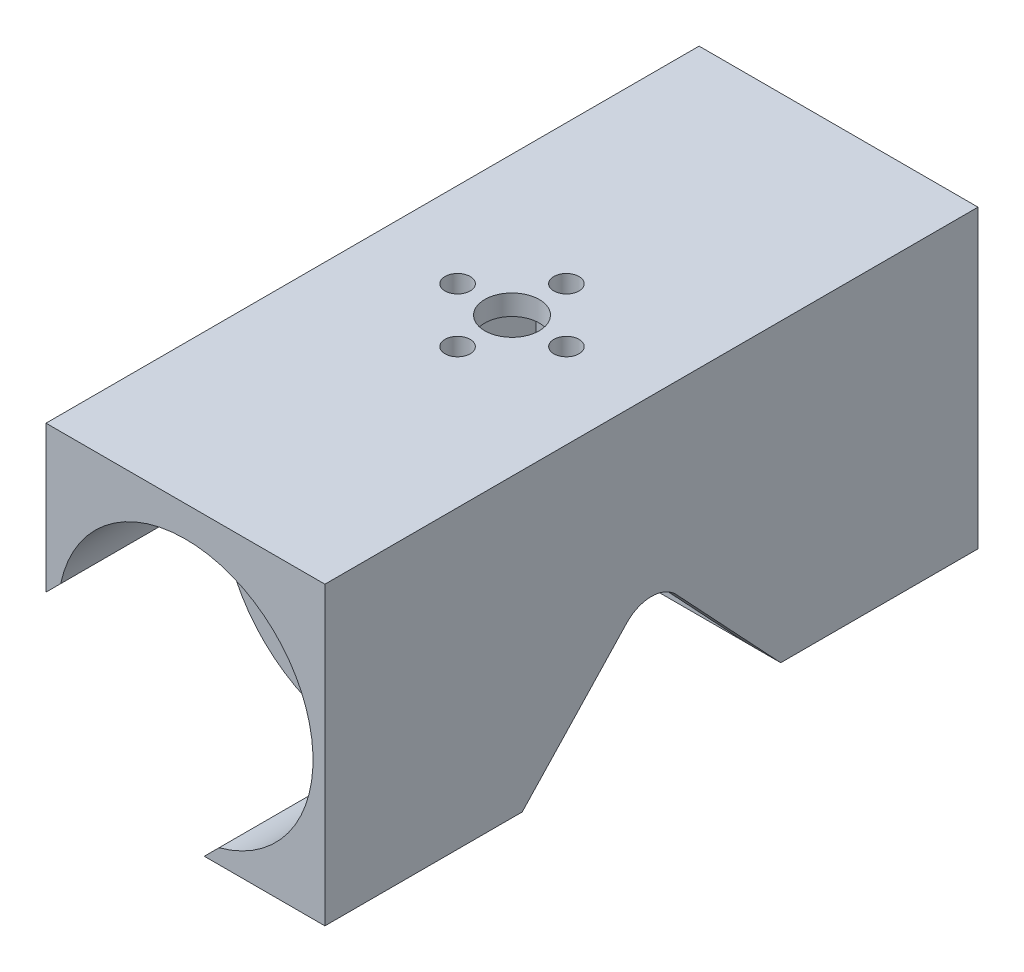
ISO-10303-21;
HEADER;
FILE_DESCRIPTION(('STEP AP214'),'2;1');
FILE_NAME('part.step','',(''),(''),'','','');
FILE_SCHEMA(('AUTOMOTIVE_DESIGN { 1 0 10303 214 1 1 1 1 }'));
ENDSEC;
DATA;
#1=APPLICATION_CONTEXT('core data for automotive mechanical design processes');
#2=APPLICATION_PROTOCOL_DEFINITION('international standard','automotive_design',2000,#1);
#3=PRODUCT_CONTEXT('',#1,'mechanical');
#4=PRODUCT('Part','Part','',(#3));
#5=PRODUCT_RELATED_PRODUCT_CATEGORY('part','',(#4));
#6=PRODUCT_DEFINITION_FORMATION('','',#4);
#7=PRODUCT_DEFINITION_CONTEXT('part definition',#1,'design');
#8=PRODUCT_DEFINITION('design','',#6,#7);
#9=PRODUCT_DEFINITION_SHAPE('','',#8);
#10=(LENGTH_UNIT() NAMED_UNIT(*) SI_UNIT(.MILLI.,.METRE.));
#11=(NAMED_UNIT(*) PLANE_ANGLE_UNIT() SI_UNIT($,.RADIAN.));
#12=(NAMED_UNIT(*) SI_UNIT($,.STERADIAN.) SOLID_ANGLE_UNIT());
#13=UNCERTAINTY_MEASURE_WITH_UNIT(LENGTH_MEASURE(1.E-05),#10,'distance_accuracy_value','');
#14=(GEOMETRIC_REPRESENTATION_CONTEXT(3) GLOBAL_UNCERTAINTY_ASSIGNED_CONTEXT((#13)) GLOBAL_UNIT_ASSIGNED_CONTEXT((#10,
#11,#12)) REPRESENTATION_CONTEXT('',''));
#15=CARTESIAN_POINT('',(0.,0.,0.));
#16=DIRECTION('',(0.,0.,1.));
#17=DIRECTION('',(1.,0.,0.));
#18=AXIS2_PLACEMENT_3D('',#15,#16,#17);
#19=CARTESIAN_POINT('',(0.,-3.,0.));
#20=DIRECTION('',(0.,1.,0.));
#21=DIRECTION('',(0.,0.,1.));
#22=AXIS2_PLACEMENT_3D('',#19,#20,#21);
#23=PLANE('',#22);
#24=CARTESIAN_POINT('',(0.,-3.,0.));
#25=DIRECTION('',(0.,1.,0.));
#26=DIRECTION('',(0.,0.,1.));
#27=AXIS2_PLACEMENT_3D('',#24,#25,#26);
#28=CIRCLE('',#27,4.);
#29=CARTESIAN_POINT('',(0.,-3.,4.));
#30=VERTEX_POINT('',#29);
#31=EDGE_CURVE('E323',#30,#30,#28,.F.);
#32=ORIENTED_EDGE('',*,*,#31,.F.);
#33=EDGE_LOOP('',(#32));
#34=FACE_BOUND('',#33,.T.);
#35=CARTESIAN_POINT('',(-8.,-3.,0.));
#36=DIRECTION('',(0.,1.,0.));
#37=DIRECTION('',(0.,0.,1.));
#38=AXIS2_PLACEMENT_3D('',#35,#36,#37);
#39=CIRCLE('',#38,1.85);
#40=CARTESIAN_POINT('',(-8.,-3.,1.85));
#41=VERTEX_POINT('',#40);
#42=EDGE_CURVE('E315',#41,#41,#39,.F.);
#43=ORIENTED_EDGE('',*,*,#42,.F.);
#44=EDGE_LOOP('',(#43));
#45=FACE_BOUND('',#44,.T.);
#46=CARTESIAN_POINT('',(8.,-3.,0.));
#47=DIRECTION('',(0.,1.,0.));
#48=DIRECTION('',(0.,0.,1.));
#49=AXIS2_PLACEMENT_3D('',#46,#47,#48);
#50=CIRCLE('',#49,1.85);
#51=CARTESIAN_POINT('',(8.,-3.,1.85));
#52=VERTEX_POINT('',#51);
#53=EDGE_CURVE('E310',#52,#52,#50,.F.);
#54=ORIENTED_EDGE('',*,*,#53,.F.);
#55=EDGE_LOOP('',(#54));
#56=FACE_BOUND('',#55,.T.);
#57=CARTESIAN_POINT('',(0.,-3.,-8.));
#58=DIRECTION('',(0.,1.,0.));
#59=DIRECTION('',(0.,0.,1.));
#60=AXIS2_PLACEMENT_3D('',#57,#58,#59);
#61=CIRCLE('',#60,1.85);
#62=CARTESIAN_POINT('',(0.,-3.,-6.15));
#63=VERTEX_POINT('',#62);
#64=EDGE_CURVE('E311',#63,#63,#61,.F.);
#65=ORIENTED_EDGE('',*,*,#64,.F.);
#66=EDGE_LOOP('',(#65));
#67=FACE_BOUND('',#66,.T.);
#68=CARTESIAN_POINT('',(0.,-3.,8.));
#69=DIRECTION('',(0.,1.,0.));
#70=DIRECTION('',(0.,0.,1.));
#71=AXIS2_PLACEMENT_3D('',#68,#69,#70);
#72=CIRCLE('',#71,1.85);
#73=CARTESIAN_POINT('',(0.,-3.,9.85));
#74=VERTEX_POINT('',#73);
#75=EDGE_CURVE('E319',#74,#74,#72,.F.);
#76=ORIENTED_EDGE('',*,*,#75,.F.);
#77=EDGE_LOOP('',(#76));
#78=FACE_BOUND('',#77,.T.);
#79=DIRECTION('',(0.,0.,-1.));
#80=VECTOR('',#79,1.);
#81=CARTESIAN_POINT('',(-15.5,-3.,0.));
#82=LINE('',#81,#80);
#83=CARTESIAN_POINT('',(-15.5,-3.,19.));
#84=VERTEX_POINT('',#83);
#85=CARTESIAN_POINT('',(-15.5,-3.,-19.));
#86=VERTEX_POINT('',#85);
#87=EDGE_CURVE('E232',#84,#86,#82,.T.);
#88=ORIENTED_EDGE('',*,*,#87,.T.);
#89=DIRECTION('',(1.,0.,0.));
#90=VECTOR('',#89,1.);
#91=CARTESIAN_POINT('',(-20.5,-3.,-19.));
#92=LINE('',#91,#90);
#93=CARTESIAN_POINT('',(15.5,-3.,-19.));
#94=VERTEX_POINT('',#93);
#95=EDGE_CURVE('E67',#86,#94,#92,.T.);
#96=ORIENTED_EDGE('',*,*,#95,.T.);
#97=DIRECTION('',(0.,0.,1.));
#98=VECTOR('',#97,1.);
#99=CARTESIAN_POINT('',(15.5,-3.,0.));
#100=LINE('',#99,#98);
#101=CARTESIAN_POINT('',(15.5,-3.,19.));
#102=VERTEX_POINT('',#101);
#103=EDGE_CURVE('E262',#94,#102,#100,.T.);
#104=ORIENTED_EDGE('',*,*,#103,.T.);
#105=DIRECTION('',(-1.,0.,0.));
#106=VECTOR('',#105,1.);
#107=CARTESIAN_POINT('',(-20.5,-3.,19.));
#108=LINE('',#107,#106);
#109=EDGE_CURVE('E306',#102,#84,#108,.T.);
#110=ORIENTED_EDGE('',*,*,#109,.T.);
#111=EDGE_LOOP('',(#88,#96,#104,#110));
#112=FACE_BOUND('',#111,.T.);
#113=ADVANCED_FACE('F43',(#34,#45,#56,#67,#78,#112),#23,.F.);
#114=CARTESIAN_POINT('',(-20.5,55.9016994374948,-19.));
#115=DIRECTION('',(0.,0.,-1.));
#116=DIRECTION('',(-1.,0.,0.));
#117=AXIS2_PLACEMENT_3D('',#114,#115,#116);
#118=PLANE('',#117);
#119=DIRECTION('',(0.,-1.,0.));
#120=VECTOR('',#119,1.);
#121=CARTESIAN_POINT('',(-15.5,-43.5,-19.));
#122=LINE('',#121,#120);
#123=CARTESIAN_POINT('',(-15.5,-36.6367818419969,-19.));
#124=VERTEX_POINT('',#123);
#125=EDGE_CURVE('E228',#86,#124,#122,.T.);
#126=ORIENTED_EDGE('',*,*,#125,.T.);
#127=CARTESIAN_POINT('',(0.,-23.1240760574621,-19.));
#128=DIRECTION('',(0.,0.,-1.));
#129=DIRECTION('',(-1.,0.,0.));
#130=AXIS2_PLACEMENT_3D('',#127,#128,#129);
#131=CIRCLE('',#130,20.5631519378572);
#132=CARTESIAN_POINT('',(-2.76856300403509,-43.5,-19.));
#133=VERTEX_POINT('',#132);
#134=EDGE_CURVE('E59',#124,#133,#131,.F.);
#135=ORIENTED_EDGE('',*,*,#134,.T.);
#136=DIRECTION('',(1.,0.,0.));
#137=VECTOR('',#136,1.);
#138=CARTESIAN_POINT('',(-20.5,-43.5,-19.));
#139=LINE('',#138,#137);
#140=CARTESIAN_POINT('',(15.5,-43.5,-19.));
#141=VERTEX_POINT('',#140);
#142=EDGE_CURVE('E290',#133,#141,#139,.T.);
#143=ORIENTED_EDGE('',*,*,#142,.T.);
#144=DIRECTION('',(0.,1.,0.));
#145=VECTOR('',#144,1.);
#146=CARTESIAN_POINT('',(15.5,-43.5,-19.));
#147=LINE('',#146,#145);
#148=EDGE_CURVE('E258',#141,#94,#147,.T.);
#149=ORIENTED_EDGE('',*,*,#148,.T.);
#150=ORIENTED_EDGE('',*,*,#95,.F.);
#151=EDGE_LOOP('',(#126,#135,#143,#149,#150));
#152=FACE_BOUND('',#151,.T.);
#153=ADVANCED_FACE('F479',(#152),#118,.F.);
#154=CARTESIAN_POINT('',(-20.5,55.9016994374948,19.));
#155=DIRECTION('',(0.,0.,1.));
#156=DIRECTION('',(1.,0.,0.));
#157=AXIS2_PLACEMENT_3D('',#154,#155,#156);
#158=PLANE('',#157);
#159=DIRECTION('',(-1.,0.,0.));
#160=VECTOR('',#159,1.);
#161=CARTESIAN_POINT('',(-20.5,-43.5,19.));
#162=LINE('',#161,#160);
#163=CARTESIAN_POINT('',(15.5,-43.5,19.));
#164=VERTEX_POINT('',#163);
#165=CARTESIAN_POINT('',(-2.76856300403509,-43.5,19.));
#166=VERTEX_POINT('',#165);
#167=EDGE_CURVE('E301',#164,#166,#162,.T.);
#168=ORIENTED_EDGE('',*,*,#167,.T.);
#169=CARTESIAN_POINT('',(0.,-23.1240760574621,19.));
#170=DIRECTION('',(0.,0.,1.));
#171=DIRECTION('',(1.,0.,0.));
#172=AXIS2_PLACEMENT_3D('',#169,#170,#171);
#173=CIRCLE('',#172,20.5631519378572);
#174=CARTESIAN_POINT('',(-15.5,-36.6367818419969,19.));
#175=VERTEX_POINT('',#174);
#176=EDGE_CURVE('E502',#166,#175,#173,.F.);
#177=ORIENTED_EDGE('',*,*,#176,.T.);
#178=DIRECTION('',(0.,1.,0.));
#179=VECTOR('',#178,1.);
#180=CARTESIAN_POINT('',(-15.5,-43.5,19.));
#181=LINE('',#180,#179);
#182=EDGE_CURVE('E240',#175,#84,#181,.T.);
#183=ORIENTED_EDGE('',*,*,#182,.T.);
#184=ORIENTED_EDGE('',*,*,#109,.F.);
#185=DIRECTION('',(0.,-1.,0.));
#186=VECTOR('',#185,1.);
#187=CARTESIAN_POINT('',(15.5,-43.5,19.));
#188=LINE('',#187,#186);
#189=EDGE_CURVE('E265',#102,#164,#188,.T.);
#190=ORIENTED_EDGE('',*,*,#189,.T.);
#191=EDGE_LOOP('',(#168,#177,#183,#184,#190));
#192=FACE_BOUND('',#191,.T.);
#193=ADVANCED_FACE('F498',(#192),#158,.F.);
#194=CARTESIAN_POINT('',(0.,-43.5,0.));
#195=DIRECTION('',(0.,1.,0.));
#196=DIRECTION('',(0.,0.,1.));
#197=AXIS2_PLACEMENT_3D('',#194,#195,#196);
#198=PLANE('',#197);
#199=DIRECTION('',(1.,0.,0.));
#200=VECTOR('',#199,1.);
#201=CARTESIAN_POINT('',(0.,-43.5,-22.));
#202=LINE('',#201,#200);
#203=CARTESIAN_POINT('',(-2.76856300403509,-43.5,-22.));
#204=VERTEX_POINT('',#203);
#205=CARTESIAN_POINT('',(2.76856300403512,-43.5,-22.));
#206=VERTEX_POINT('',#205);
#207=EDGE_CURVE('E340',#204,#206,#202,.T.);
#208=ORIENTED_EDGE('',*,*,#207,.T.);
#209=DIRECTION('',(0.,0.,-1.));
#210=VECTOR('',#209,1.);
#211=CARTESIAN_POINT('',(2.76856300403512,-43.5,-22.));
#212=LINE('',#211,#210);
#213=CARTESIAN_POINT('',(2.76856300403512,-43.5,-48.));
#214=VERTEX_POINT('',#213);
#215=EDGE_CURVE('E359',#206,#214,#212,.T.);
#216=ORIENTED_EDGE('',*,*,#215,.T.);
#217=DIRECTION('',(1.,0.,0.));
#218=VECTOR('',#217,1.);
#219=CARTESIAN_POINT('',(0.,-43.5,-48.));
#220=LINE('',#219,#218);
#221=CARTESIAN_POINT('',(20.5,-43.5,-48.));
#222=VERTEX_POINT('',#221);
#223=EDGE_CURVE('E410',#214,#222,#220,.T.);
#224=ORIENTED_EDGE('',*,*,#223,.T.);
#225=DIRECTION('',(0.,0.,1.));
#226=VECTOR('',#225,1.);
#227=CARTESIAN_POINT('',(20.5,-43.5,0.));
#228=LINE('',#227,#226);
#229=CARTESIAN_POINT('',(20.5,-43.5,-19.));
#230=VERTEX_POINT('',#229);
#231=EDGE_CURVE('E407',#222,#230,#228,.T.);
#232=ORIENTED_EDGE('',*,*,#231,.T.);
#233=DIRECTION('',(1.,0.,0.));
#234=VECTOR('',#233,1.);
#235=CARTESIAN_POINT('',(15.5,-43.5,-19.));
#236=LINE('',#235,#234);
#237=EDGE_CURVE('E276',#141,#230,#236,.T.);
#238=ORIENTED_EDGE('',*,*,#237,.F.);
#239=ORIENTED_EDGE('',*,*,#142,.F.);
#240=DIRECTION('',(0.,0.,-1.));
#241=VECTOR('',#240,1.);
#242=CARTESIAN_POINT('',(-2.76856300403509,-43.5,214.611957842271));
#243=LINE('',#242,#241);
#244=EDGE_CURVE('E692',#133,#204,#243,.T.);
#245=ORIENTED_EDGE('',*,*,#244,.T.);
#246=EDGE_LOOP('',(#208,#216,#224,#232,#238,#239,#245));
#247=FACE_BOUND('',#246,.T.);
#248=ADVANCED_FACE('F554',(#247),#198,.F.);
#249=CARTESIAN_POINT('',(-20.5,-43.5,0.));
#250=DIRECTION('',(-1.,0.,0.));
#251=DIRECTION('',(0.,0.,1.));
#252=AXIS2_PLACEMENT_3D('',#249,#250,#251);
#253=PLANE('',#252);
#254=DIRECTION('',(0.,-1.,0.));
#255=VECTOR('',#254,1.);
#256=CARTESIAN_POINT('',(-20.5,0.,22.));
#257=LINE('',#256,#255);
#258=CARTESIAN_POINT('',(-20.5,-21.5137290080961,22.));
#259=VERTEX_POINT('',#258);
#260=CARTESIAN_POINT('',(-20.5,-24.734423106828,22.));
#261=VERTEX_POINT('',#260);
#262=EDGE_CURVE('E382',#259,#261,#257,.T.);
#263=ORIENTED_EDGE('',*,*,#262,.F.);
#264=DIRECTION('',(0.,0.,-1.));
#265=VECTOR('',#264,1.);
#266=CARTESIAN_POINT('',(-20.5,-21.5137290080961,48.000012));
#267=LINE('',#266,#265);
#268=CARTESIAN_POINT('',(-20.5,-21.5137290080961,48.));
#269=VERTEX_POINT('',#268);
#270=EDGE_CURVE('E396',#269,#259,#267,.T.);
#271=ORIENTED_EDGE('',*,*,#270,.F.);
#272=DIRECTION('',(0.,1.,0.));
#273=VECTOR('',#272,1.);
#274=CARTESIAN_POINT('',(-20.5,-43.5,48.));
#275=LINE('',#274,#273);
#276=CARTESIAN_POINT('',(-20.5,0.,48.));
#277=VERTEX_POINT('',#276);
#278=EDGE_CURVE('E457',#269,#277,#275,.T.);
#279=ORIENTED_EDGE('',*,*,#278,.T.);
#280=DIRECTION('',(0.,0.,1.));
#281=VECTOR('',#280,1.);
#282=CARTESIAN_POINT('',(-20.5,0.,0.));
#283=LINE('',#282,#281);
#284=CARTESIAN_POINT('',(-20.5,0.,-48.));
#285=VERTEX_POINT('',#284);
#286=EDGE_CURVE('E445',#285,#277,#283,.T.);
#287=ORIENTED_EDGE('',*,*,#286,.F.);
#288=DIRECTION('',(0.,1.,0.));
#289=VECTOR('',#288,1.);
#290=CARTESIAN_POINT('',(-20.5,-43.5,-48.));
#291=LINE('',#290,#289);
#292=CARTESIAN_POINT('',(-20.5,-21.5137290080961,-48.));
#293=VERTEX_POINT('',#292);
#294=EDGE_CURVE('E460',#293,#285,#291,.T.);
#295=ORIENTED_EDGE('',*,*,#294,.F.);
#296=DIRECTION('',(0.,0.,-1.));
#297=VECTOR('',#296,1.);
#298=CARTESIAN_POINT('',(-20.5,-21.5137290080961,-22.));
#299=LINE('',#298,#297);
#300=CARTESIAN_POINT('',(-20.5,-21.5137290080961,-22.));
#301=VERTEX_POINT('',#300);
#302=EDGE_CURVE('E363',#301,#293,#299,.T.);
#303=ORIENTED_EDGE('',*,*,#302,.F.);
#304=DIRECTION('',(0.,-1.,0.));
#305=VECTOR('',#304,1.);
#306=CARTESIAN_POINT('',(-20.5,-43.5,-22.));
#307=LINE('',#306,#305);
#308=CARTESIAN_POINT('',(-20.5,-24.734423106828,-22.));
#309=VERTEX_POINT('',#308);
#310=EDGE_CURVE('E336',#301,#309,#307,.T.);
#311=ORIENTED_EDGE('',*,*,#310,.T.);
#312=DIRECTION('',(0.,0.,-1.));
#313=VECTOR('',#312,1.);
#314=CARTESIAN_POINT('',(-20.5,-24.734423106828,214.611957842271));
#315=LINE('',#314,#313);
#316=EDGE_CURVE('E676',#261,#309,#315,.T.);
#317=ORIENTED_EDGE('',*,*,#316,.F.);
#318=EDGE_LOOP('',(#263,#271,#279,#287,#295,#303,#311,#317));
#319=FACE_BOUND('',#318,.T.);
#320=ADVANCED_FACE('F603',(#319),#253,.T.);
#321=CARTESIAN_POINT('',(0.,-43.5,-48.));
#322=DIRECTION('',(0.,0.,1.));
#323=DIRECTION('',(1.,0.,0.));
#324=AXIS2_PLACEMENT_3D('',#321,#322,#323);
#325=PLANE('',#324);
#326=DIRECTION('',(-0.707106781186552,-0.707106781186544,0.));
#327=VECTOR('',#326,1.);
#328=CARTESIAN_POINT('',(-21.2431354959519,-22.2568645040479,-48.));
#329=LINE('',#328,#327);
#330=CARTESIAN_POINT('',(-18.3408990317223,-19.3546280398183,-48.));
#331=VERTEX_POINT('',#330);
#332=EDGE_CURVE('E350',#331,#293,#329,.T.);
#333=ORIENTED_EDGE('',*,*,#332,.T.);
#334=ORIENTED_EDGE('',*,*,#294,.T.);
#335=DIRECTION('',(1.,0.,0.));
#336=VECTOR('',#335,1.);
#337=CARTESIAN_POINT('',(0.,0.,-48.));
#338=LINE('',#337,#336);
#339=CARTESIAN_POINT('',(20.5,0.,-48.));
#340=VERTEX_POINT('',#339);
#341=EDGE_CURVE('E442',#285,#340,#338,.T.);
#342=ORIENTED_EDGE('',*,*,#341,.T.);
#343=DIRECTION('',(0.,1.,0.));
#344=VECTOR('',#343,1.);
#345=CARTESIAN_POINT('',(20.5,-43.5,-48.));
#346=LINE('',#345,#344);
#347=EDGE_CURVE('E418',#222,#340,#346,.T.);
#348=ORIENTED_EDGE('',*,*,#347,.F.);
#349=ORIENTED_EDGE('',*,*,#223,.F.);
#350=DIRECTION('',(0.707106781186551,0.707106781186544,0.));
#351=VECTOR('',#350,1.);
#352=CARTESIAN_POINT('',(1.38428150201755,-44.8842815020176,-48.));
#353=LINE('',#352,#351);
#354=CARTESIAN_POINT('',(4.92766397231287,-41.3408990317223,-48.));
#355=VERTEX_POINT('',#354);
#356=EDGE_CURVE('E333',#214,#355,#353,.T.);
#357=ORIENTED_EDGE('',*,*,#356,.T.);
#358=CARTESIAN_POINT('',(0.,-23.25,-48.));
#359=DIRECTION('',(0.,0.,1.));
#360=DIRECTION('',(1.,0.,0.));
#361=AXIS2_PLACEMENT_3D('',#358,#359,#360);
#362=CIRCLE('',#361,18.75);
#363=EDGE_CURVE('E327',#355,#331,#362,.T.);
#364=ORIENTED_EDGE('',*,*,#363,.T.);
#365=EDGE_LOOP('',(#333,#334,#342,#348,#349,#357,#364));
#366=FACE_BOUND('',#365,.T.);
#367=ADVANCED_FACE('F593',(#366),#325,.F.);
#368=DIRECTION('',(0.,0.,-1.));
#369=VECTOR('',#368,1.);
#370=CARTESIAN_POINT('',(-2.76856300403509,-43.5,214.611957842271));
#371=LINE('',#370,#369);
#372=CARTESIAN_POINT('',(-2.76856300403509,-43.5,22.));
#373=VERTEX_POINT('',#372);
#374=EDGE_CURVE('E234',#373,#166,#371,.T.);
#375=ORIENTED_EDGE('',*,*,#374,.T.);
#376=ORIENTED_EDGE('',*,*,#167,.F.);
#377=CARTESIAN_POINT('',(20.5,-43.5,19.));
#378=VERTEX_POINT('',#377);
#379=EDGE_CURVE('E297',#378,#164,#162,.T.);
#380=ORIENTED_EDGE('',*,*,#379,.F.);
#381=CARTESIAN_POINT('',(20.5,-43.5,48.));
#382=VERTEX_POINT('',#381);
#383=EDGE_CURVE('E411',#378,#382,#228,.T.);
#384=ORIENTED_EDGE('',*,*,#383,.T.);
#385=DIRECTION('',(1.,0.,0.));
#386=VECTOR('',#385,1.);
#387=CARTESIAN_POINT('',(0.,-43.5,48.));
#388=LINE('',#387,#386);
#389=CARTESIAN_POINT('',(2.76856300403512,-43.5,48.));
#390=VERTEX_POINT('',#389);
#391=EDGE_CURVE('E414',#390,#382,#388,.T.);
#392=ORIENTED_EDGE('',*,*,#391,.F.);
#393=DIRECTION('',(0.,0.,-1.));
#394=VECTOR('',#393,1.);
#395=CARTESIAN_POINT('',(2.76856300403513,-43.5,0.));
#396=LINE('',#395,#394);
#397=CARTESIAN_POINT('',(2.76856300403512,-43.5,22.));
#398=VERTEX_POINT('',#397);
#399=EDGE_CURVE('E456',#390,#398,#396,.T.);
#400=ORIENTED_EDGE('',*,*,#399,.T.);
#401=DIRECTION('',(1.,0.,0.));
#402=VECTOR('',#401,1.);
#403=CARTESIAN_POINT('',(0.,-43.5,22.));
#404=LINE('',#403,#402);
#405=EDGE_CURVE('E386',#373,#398,#404,.T.);
#406=ORIENTED_EDGE('',*,*,#405,.F.);
#407=EDGE_LOOP('',(#375,#376,#380,#384,#392,#400,#406));
#408=FACE_BOUND('',#407,.T.);
#409=ADVANCED_FACE('F589',(#408),#198,.F.);
#410=CARTESIAN_POINT('',(20.5,-43.5,0.));
#411=DIRECTION('',(-1.,0.,0.));
#412=DIRECTION('',(0.,0.,1.));
#413=AXIS2_PLACEMENT_3D('',#410,#411,#412);
#414=PLANE('',#413);
#415=DIRECTION('',(0.,-0.729256378683583,-0.684240552838917));
#416=VECTOR('',#415,1.);
#417=CARTESIAN_POINT('',(20.5,-34.0192510334765,-10.1044824511632));
#418=LINE('',#417,#416);
#419=CARTESIAN_POINT('',(20.5,-27.1361688600902,-3.64628189341794));
#420=VERTEX_POINT('',#419);
#421=EDGE_CURVE('E253',#420,#230,#418,.T.);
#422=ORIENTED_EDGE('',*,*,#421,.T.);
#423=ORIENTED_EDGE('',*,*,#231,.F.);
#424=ORIENTED_EDGE('',*,*,#347,.T.);
#425=DIRECTION('',(0.,0.,1.));
#426=VECTOR('',#425,1.);
#427=CARTESIAN_POINT('',(20.5,0.,0.));
#428=LINE('',#427,#426);
#429=CARTESIAN_POINT('',(20.5,0.,48.));
#430=VERTEX_POINT('',#429);
#431=EDGE_CURVE('E438',#340,#430,#428,.T.);
#432=ORIENTED_EDGE('',*,*,#431,.T.);
#433=DIRECTION('',(0.,1.,0.));
#434=VECTOR('',#433,1.);
#435=CARTESIAN_POINT('',(20.5,-43.5,48.));
#436=LINE('',#435,#434);
#437=EDGE_CURVE('E453',#382,#430,#436,.T.);
#438=ORIENTED_EDGE('',*,*,#437,.F.);
#439=ORIENTED_EDGE('',*,*,#383,.F.);
#440=DIRECTION('',(0.,0.729256378683583,-0.684240552838917));
#441=VECTOR('',#440,1.);
#442=CARTESIAN_POINT('',(20.5,-34.0192510334765,10.1044824511632));
#443=LINE('',#442,#441);
#444=CARTESIAN_POINT('',(20.5,-27.1361688600902,3.64628189341794));
#445=VERTEX_POINT('',#444);
#446=EDGE_CURVE('E280',#378,#445,#443,.T.);
#447=ORIENTED_EDGE('',*,*,#446,.T.);
#448=CARTESIAN_POINT('',(20.5,-30.5573716242847,0.));
#449=DIRECTION('',(-1.,0.,0.));
#450=DIRECTION('',(0.,0.,1.));
#451=AXIS2_PLACEMENT_3D('',#448,#449,#450);
#452=CIRCLE('',#451,5.);
#453=EDGE_CURVE('E259',#445,#420,#452,.T.);
#454=ORIENTED_EDGE('',*,*,#453,.T.);
#455=EDGE_LOOP('',(#422,#423,#424,#432,#438,#439,#447,#454));
#456=FACE_BOUND('',#455,.T.);
#457=ADVANCED_FACE('F592',(#456),#414,.F.);
#458=CARTESIAN_POINT('',(0.,-43.5,48.));
#459=DIRECTION('',(0.,0.,1.));
#460=DIRECTION('',(1.,0.,0.));
#461=AXIS2_PLACEMENT_3D('',#458,#459,#460);
#462=PLANE('',#461);
#463=DIRECTION('',(0.707106781186551,0.707106781186544,0.));
#464=VECTOR('',#463,1.);
#465=CARTESIAN_POINT('',(1.38428150201755,-44.8842815020176,48.));
#466=LINE('',#465,#464);
#467=CARTESIAN_POINT('',(4.92766397231288,-41.3408990317223,48.));
#468=VERTEX_POINT('',#467);
#469=EDGE_CURVE('E399',#390,#468,#466,.T.);
#470=ORIENTED_EDGE('',*,*,#469,.F.);
#471=ORIENTED_EDGE('',*,*,#391,.T.);
#472=ORIENTED_EDGE('',*,*,#437,.T.);
#473=DIRECTION('',(1.,0.,0.));
#474=VECTOR('',#473,1.);
#475=CARTESIAN_POINT('',(0.,0.,48.));
#476=LINE('',#475,#474);
#477=EDGE_CURVE('E449',#277,#430,#476,.T.);
#478=ORIENTED_EDGE('',*,*,#477,.F.);
#479=ORIENTED_EDGE('',*,*,#278,.F.);
#480=DIRECTION('',(0.707106781186551,0.707106781186544,0.));
#481=VECTOR('',#480,1.);
#482=CARTESIAN_POINT('',(-21.2431354959519,-22.2568645040479,48.));
#483=LINE('',#482,#481);
#484=CARTESIAN_POINT('',(-18.3408990317223,-19.3546280398183,48.));
#485=VERTEX_POINT('',#484);
#486=EDGE_CURVE('E402',#269,#485,#483,.T.);
#487=ORIENTED_EDGE('',*,*,#486,.T.);
#488=CARTESIAN_POINT('',(0.,-23.25,48.));
#489=DIRECTION('',(0.,0.,1.));
#490=DIRECTION('',(1.,0.,0.));
#491=AXIS2_PLACEMENT_3D('',#488,#489,#490);
#492=CIRCLE('',#491,18.75);
#493=EDGE_CURVE('E211',#468,#485,#492,.T.);
#494=ORIENTED_EDGE('',*,*,#493,.F.);
#495=EDGE_LOOP('',(#470,#471,#472,#478,#479,#487,#494));
#496=FACE_BOUND('',#495,.T.);
#497=ADVANCED_FACE('F598',(#496),#462,.T.);
#498=CARTESIAN_POINT('',(0.,-43.5,0.));
#499=DIRECTION('',(0.,1.,0.));
#500=DIRECTION('',(0.,0.,1.));
#501=AXIS2_PLACEMENT_3D('',#498,#499,#500);
#502=CYLINDRICAL_SURFACE('',#501,4.);
#503=ORIENTED_EDGE('',*,*,#31,.T.);
#504=EDGE_LOOP('',(#503));
#505=FACE_BOUND('',#504,.T.);
#506=CARTESIAN_POINT('',(0.,0.,0.));
#507=DIRECTION('',(0.,1.,0.));
#508=DIRECTION('',(0.,0.,1.));
#509=AXIS2_PLACEMENT_3D('',#506,#507,#508);
#510=CIRCLE('',#509,4.);
#511=CARTESIAN_POINT('',(0.,0.,4.));
#512=VERTEX_POINT('',#511);
#513=EDGE_CURVE('E434',#512,#512,#510,.T.);
#514=ORIENTED_EDGE('',*,*,#513,.T.);
#515=EDGE_LOOP('',(#514));
#516=FACE_BOUND('',#515,.T.);
#517=ADVANCED_FACE('F601',(#505,#516),#502,.F.);
#518=CARTESIAN_POINT('',(0.,-43.5,8.));
#519=DIRECTION('',(0.,1.,0.));
#520=DIRECTION('',(0.,0.,1.));
#521=AXIS2_PLACEMENT_3D('',#518,#519,#520);
#522=CYLINDRICAL_SURFACE('',#521,1.85);
#523=ORIENTED_EDGE('',*,*,#75,.T.);
#524=EDGE_LOOP('',(#523));
#525=FACE_BOUND('',#524,.T.);
#526=CARTESIAN_POINT('',(0.,0.,8.));
#527=DIRECTION('',(0.,1.,0.));
#528=DIRECTION('',(0.,0.,1.));
#529=AXIS2_PLACEMENT_3D('',#526,#527,#528);
#530=CIRCLE('',#529,1.85);
#531=CARTESIAN_POINT('',(0.,0.,9.85));
#532=VERTEX_POINT('',#531);
#533=EDGE_CURVE('E430',#532,#532,#530,.T.);
#534=ORIENTED_EDGE('',*,*,#533,.T.);
#535=EDGE_LOOP('',(#534));
#536=FACE_BOUND('',#535,.T.);
#537=ADVANCED_FACE('F615',(#525,#536),#522,.F.);
#538=CARTESIAN_POINT('',(-8.,-43.5,0.));
#539=DIRECTION('',(0.,1.,0.));
#540=DIRECTION('',(0.,0.,1.));
#541=AXIS2_PLACEMENT_3D('',#538,#539,#540);
#542=CYLINDRICAL_SURFACE('',#541,1.85);
#543=ORIENTED_EDGE('',*,*,#42,.T.);
#544=EDGE_LOOP('',(#543));
#545=FACE_BOUND('',#544,.T.);
#546=CARTESIAN_POINT('',(-8.,0.,0.));
#547=DIRECTION('',(0.,1.,0.));
#548=DIRECTION('',(0.,0.,1.));
#549=AXIS2_PLACEMENT_3D('',#546,#547,#548);
#550=CIRCLE('',#549,1.85);
#551=CARTESIAN_POINT('',(-8.,0.,1.85));
#552=VERTEX_POINT('',#551);
#553=EDGE_CURVE('E426',#552,#552,#550,.T.);
#554=ORIENTED_EDGE('',*,*,#553,.T.);
#555=EDGE_LOOP('',(#554));
#556=FACE_BOUND('',#555,.T.);
#557=ADVANCED_FACE('F619',(#545,#556),#542,.F.);
#558=CARTESIAN_POINT('',(0.,-43.5,-8.));
#559=DIRECTION('',(0.,1.,0.));
#560=DIRECTION('',(0.,0.,1.));
#561=AXIS2_PLACEMENT_3D('',#558,#559,#560);
#562=CYLINDRICAL_SURFACE('',#561,1.85);
#563=ORIENTED_EDGE('',*,*,#64,.T.);
#564=EDGE_LOOP('',(#563));
#565=FACE_BOUND('',#564,.T.);
#566=CARTESIAN_POINT('',(0.,0.,-8.));
#567=DIRECTION('',(0.,1.,0.));
#568=DIRECTION('',(0.,0.,1.));
#569=AXIS2_PLACEMENT_3D('',#566,#567,#568);
#570=CIRCLE('',#569,1.85);
#571=CARTESIAN_POINT('',(0.,0.,-6.15));
#572=VERTEX_POINT('',#571);
#573=EDGE_CURVE('E422',#572,#572,#570,.T.);
#574=ORIENTED_EDGE('',*,*,#573,.T.);
#575=EDGE_LOOP('',(#574));
#576=FACE_BOUND('',#575,.T.);
#577=ADVANCED_FACE('F622',(#565,#576),#562,.F.);
#578=CARTESIAN_POINT('',(8.,-43.5,0.));
#579=DIRECTION('',(0.,1.,0.));
#580=DIRECTION('',(0.,0.,1.));
#581=AXIS2_PLACEMENT_3D('',#578,#579,#580);
#582=CYLINDRICAL_SURFACE('',#581,1.85);
#583=ORIENTED_EDGE('',*,*,#53,.T.);
#584=EDGE_LOOP('',(#583));
#585=FACE_BOUND('',#584,.T.);
#586=CARTESIAN_POINT('',(8.,0.,0.));
#587=DIRECTION('',(0.,1.,0.));
#588=DIRECTION('',(0.,0.,1.));
#589=AXIS2_PLACEMENT_3D('',#586,#587,#588);
#590=CIRCLE('',#589,1.85);
#591=CARTESIAN_POINT('',(8.,0.,1.85));
#592=VERTEX_POINT('',#591);
#593=EDGE_CURVE('E406',#592,#592,#590,.T.);
#594=ORIENTED_EDGE('',*,*,#593,.T.);
#595=EDGE_LOOP('',(#594));
#596=FACE_BOUND('',#595,.T.);
#597=ADVANCED_FACE('F45',(#585,#596),#582,.F.);
#598=CARTESIAN_POINT('',(0.,0.,0.));
#599=DIRECTION('',(0.,1.,0.));
#600=DIRECTION('',(0.,0.,1.));
#601=AXIS2_PLACEMENT_3D('',#598,#599,#600);
#602=PLANE('',#601);
#603=ORIENTED_EDGE('',*,*,#593,.F.);
#604=EDGE_LOOP('',(#603));
#605=FACE_BOUND('',#604,.T.);
#606=ORIENTED_EDGE('',*,*,#573,.F.);
#607=EDGE_LOOP('',(#606));
#608=FACE_BOUND('',#607,.T.);
#609=ORIENTED_EDGE('',*,*,#553,.F.);
#610=EDGE_LOOP('',(#609));
#611=FACE_BOUND('',#610,.T.);
#612=ORIENTED_EDGE('',*,*,#533,.F.);
#613=EDGE_LOOP('',(#612));
#614=FACE_BOUND('',#613,.T.);
#615=ORIENTED_EDGE('',*,*,#513,.F.);
#616=EDGE_LOOP('',(#615));
#617=FACE_BOUND('',#616,.T.);
#618=ORIENTED_EDGE('',*,*,#431,.F.);
#619=ORIENTED_EDGE('',*,*,#341,.F.);
#620=ORIENTED_EDGE('',*,*,#286,.T.);
#621=ORIENTED_EDGE('',*,*,#477,.T.);
#622=EDGE_LOOP('',(#618,#619,#620,#621));
#623=FACE_BOUND('',#622,.T.);
#624=ADVANCED_FACE('F587',(#605,#608,#611,#614,#617,#623),#602,.T.);
#625=CARTESIAN_POINT('',(23.1342815020175,-23.1342815020178,48.000012));
#626=DIRECTION('',(0.707106781186544,-0.707106781186551,0.));
#627=DIRECTION('',(0.707106781186551,0.707106781186544,0.));
#628=AXIS2_PLACEMENT_3D('',#625,#626,#627);
#629=PLANE('',#628);
#630=ORIENTED_EDGE('',*,*,#469,.T.);
#631=DIRECTION('',(0.,0.,1.));
#632=VECTOR('',#631,1.);
#633=CARTESIAN_POINT('',(4.92766397231287,-41.3408990317223,22.));
#634=LINE('',#633,#632);
#635=CARTESIAN_POINT('',(4.92766397231287,-41.3408990317223,22.));
#636=VERTEX_POINT('',#635);
#637=EDGE_CURVE('E389',#636,#468,#634,.T.);
#638=ORIENTED_EDGE('',*,*,#637,.F.);
#639=DIRECTION('',(-0.707106781186551,-0.707106781186544,0.));
#640=VECTOR('',#639,1.);
#641=CARTESIAN_POINT('',(23.1342815020175,-23.1342815020178,22.));
#642=LINE('',#641,#640);
#643=EDGE_CURVE('E370',#636,#398,#642,.T.);
#644=ORIENTED_EDGE('',*,*,#643,.T.);
#645=ORIENTED_EDGE('',*,*,#399,.F.);
#646=EDGE_LOOP('',(#630,#638,#644,#645));
#647=FACE_BOUND('',#646,.T.);
#648=ADVANCED_FACE('F583',(#647),#629,.F.);
#649=CARTESIAN_POINT('',(0.506864504048145,-0.506864504048151,48.000012));
#650=DIRECTION('',(0.707106781186544,-0.707106781186551,0.));
#651=DIRECTION('',(0.707106781186551,0.707106781186544,0.));
#652=AXIS2_PLACEMENT_3D('',#649,#650,#651);
#653=PLANE('',#652);
#654=ORIENTED_EDGE('',*,*,#270,.T.);
#655=DIRECTION('',(-0.707106781186551,-0.707106781186544,0.));
#656=VECTOR('',#655,1.);
#657=CARTESIAN_POINT('',(0.506864504048145,-0.506864504048151,22.));
#658=LINE('',#657,#656);
#659=CARTESIAN_POINT('',(-18.3408990317223,-19.3546280398183,22.));
#660=VERTEX_POINT('',#659);
#661=EDGE_CURVE('E378',#660,#259,#658,.T.);
#662=ORIENTED_EDGE('',*,*,#661,.F.);
#663=DIRECTION('',(0.,0.,1.));
#664=VECTOR('',#663,1.);
#665=CARTESIAN_POINT('',(-18.3408990317223,-19.3546280398183,22.));
#666=LINE('',#665,#664);
#667=EDGE_CURVE('E393',#660,#485,#666,.T.);
#668=ORIENTED_EDGE('',*,*,#667,.T.);
#669=ORIENTED_EDGE('',*,*,#486,.F.);
#670=EDGE_LOOP('',(#654,#662,#668,#669));
#671=FACE_BOUND('',#670,.T.);
#672=ADVANCED_FACE('F579',(#671),#653,.T.);
#673=CARTESIAN_POINT('',(0.,-23.25,22.));
#674=DIRECTION('',(0.,0.,1.));
#675=DIRECTION('',(1.,0.,0.));
#676=AXIS2_PLACEMENT_3D('',#673,#674,#675);
#677=CYLINDRICAL_SURFACE('',#676,18.75);
#678=ORIENTED_EDGE('',*,*,#493,.T.);
#679=ORIENTED_EDGE('',*,*,#667,.F.);
#680=CARTESIAN_POINT('',(0.,-23.25,22.));
#681=DIRECTION('',(0.,0.,1.));
#682=DIRECTION('',(1.,0.,0.));
#683=AXIS2_PLACEMENT_3D('',#680,#681,#682);
#684=CIRCLE('',#683,18.75);
#685=EDGE_CURVE('E374',#636,#660,#684,.T.);
#686=ORIENTED_EDGE('',*,*,#685,.F.);
#687=ORIENTED_EDGE('',*,*,#637,.T.);
#688=EDGE_LOOP('',(#678,#679,#686,#687));
#689=FACE_BOUND('',#688,.T.);
#690=ADVANCED_FACE('F575',(#689),#677,.F.);
#691=CARTESIAN_POINT('',(0.,0.,22.));
#692=DIRECTION('',(0.,0.,1.));
#693=DIRECTION('',(1.,0.,0.));
#694=AXIS2_PLACEMENT_3D('',#691,#692,#693);
#695=PLANE('',#694);
#696=CARTESIAN_POINT('',(0.,-23.1240760574621,22.));
#697=DIRECTION('',(0.,0.,1.));
#698=DIRECTION('',(1.,0.,0.));
#699=AXIS2_PLACEMENT_3D('',#696,#697,#698);
#700=CIRCLE('',#699,20.5631519378572);
#701=EDGE_CURVE('E680',#373,#261,#700,.F.);
#702=ORIENTED_EDGE('',*,*,#701,.F.);
#703=ORIENTED_EDGE('',*,*,#405,.T.);
#704=ORIENTED_EDGE('',*,*,#643,.F.);
#705=ORIENTED_EDGE('',*,*,#685,.T.);
#706=ORIENTED_EDGE('',*,*,#661,.T.);
#707=ORIENTED_EDGE('',*,*,#262,.T.);
#708=EDGE_LOOP('',(#702,#703,#704,#705,#706,#707));
#709=FACE_BOUND('',#708,.T.);
#710=ADVANCED_FACE('F571',(#709),#695,.T.);
#711=CARTESIAN_POINT('',(0.,-23.25,-22.));
#712=DIRECTION('',(0.,0.,-1.));
#713=DIRECTION('',(-1.,0.,0.));
#714=AXIS2_PLACEMENT_3D('',#711,#712,#713);
#715=CYLINDRICAL_SURFACE('',#714,18.75);
#716=ORIENTED_EDGE('',*,*,#363,.F.);
#717=DIRECTION('',(0.,0.,-1.));
#718=VECTOR('',#717,1.);
#719=CARTESIAN_POINT('',(4.92766397231287,-41.3408990317223,-22.));
#720=LINE('',#719,#718);
#721=CARTESIAN_POINT('',(4.92766397231287,-41.3408990317223,-22.));
#722=VERTEX_POINT('',#721);
#723=EDGE_CURVE('E346',#722,#355,#720,.T.);
#724=ORIENTED_EDGE('',*,*,#723,.F.);
#725=CARTESIAN_POINT('',(0.,-23.25,-22.));
#726=DIRECTION('',(0.,0.,1.));
#727=DIRECTION('',(1.,0.,0.));
#728=AXIS2_PLACEMENT_3D('',#725,#726,#727);
#729=CIRCLE('',#728,18.75);
#730=CARTESIAN_POINT('',(-18.3408990317223,-19.3546280398183,-22.));
#731=VERTEX_POINT('',#730);
#732=EDGE_CURVE('E328',#722,#731,#729,.T.);
#733=ORIENTED_EDGE('',*,*,#732,.T.);
#734=DIRECTION('',(0.,0.,-1.));
#735=VECTOR('',#734,1.);
#736=CARTESIAN_POINT('',(-18.3408990317223,-19.3546280398183,-22.));
#737=LINE('',#736,#735);
#738=EDGE_CURVE('E366',#731,#331,#737,.T.);
#739=ORIENTED_EDGE('',*,*,#738,.T.);
#740=EDGE_LOOP('',(#716,#724,#733,#739));
#741=FACE_BOUND('',#740,.T.);
#742=ADVANCED_FACE('F567',(#741),#715,.F.);
#743=CARTESIAN_POINT('',(-21.2431354959519,-22.2568645040479,-22.));
#744=DIRECTION('',(0.707106781186544,-0.707106781186552,0.));
#745=DIRECTION('',(0.707106781186552,0.707106781186544,0.));
#746=AXIS2_PLACEMENT_3D('',#743,#744,#745);
#747=PLANE('',#746);
#748=ORIENTED_EDGE('',*,*,#332,.F.);
#749=ORIENTED_EDGE('',*,*,#738,.F.);
#750=DIRECTION('',(-0.707106781186552,-0.707106781186544,0.));
#751=VECTOR('',#750,1.);
#752=CARTESIAN_POINT('',(-21.2431354959519,-22.2568645040479,-22.));
#753=LINE('',#752,#751);
#754=EDGE_CURVE('E332',#731,#301,#753,.T.);
#755=ORIENTED_EDGE('',*,*,#754,.T.);
#756=ORIENTED_EDGE('',*,*,#302,.T.);
#757=EDGE_LOOP('',(#748,#749,#755,#756));
#758=FACE_BOUND('',#757,.T.);
#759=ADVANCED_FACE('F563',(#758),#747,.T.);
#760=CARTESIAN_POINT('',(1.38428150201755,-44.8842815020176,-22.));
#761=DIRECTION('',(-0.707106781186544,0.707106781186551,0.));
#762=DIRECTION('',(-0.707106781186551,-0.707106781186544,0.));
#763=AXIS2_PLACEMENT_3D('',#760,#761,#762);
#764=PLANE('',#763);
#765=ORIENTED_EDGE('',*,*,#356,.F.);
#766=ORIENTED_EDGE('',*,*,#215,.F.);
#767=DIRECTION('',(0.707106781186551,0.707106781186544,0.));
#768=VECTOR('',#767,1.);
#769=CARTESIAN_POINT('',(1.38428150201755,-44.8842815020176,-22.));
#770=LINE('',#769,#768);
#771=EDGE_CURVE('E343',#206,#722,#770,.T.);
#772=ORIENTED_EDGE('',*,*,#771,.T.);
#773=ORIENTED_EDGE('',*,*,#723,.T.);
#774=EDGE_LOOP('',(#765,#766,#772,#773));
#775=FACE_BOUND('',#774,.T.);
#776=ADVANCED_FACE('F559',(#775),#764,.T.);
#777=CARTESIAN_POINT('',(0.,-23.25,-22.));
#778=DIRECTION('',(0.,0.,1.));
#779=DIRECTION('',(1.,0.,0.));
#780=AXIS2_PLACEMENT_3D('',#777,#778,#779);
#781=PLANE('',#780);
#782=ORIENTED_EDGE('',*,*,#207,.F.);
#783=CARTESIAN_POINT('',(0.,-23.1240760574621,-22.));
#784=DIRECTION('',(0.,0.,1.));
#785=DIRECTION('',(1.,0.,0.));
#786=AXIS2_PLACEMENT_3D('',#783,#784,#785);
#787=CIRCLE('',#786,20.5631519378572);
#788=EDGE_CURVE('E674',#204,#309,#787,.F.);
#789=ORIENTED_EDGE('',*,*,#788,.T.);
#790=ORIENTED_EDGE('',*,*,#310,.F.);
#791=ORIENTED_EDGE('',*,*,#754,.F.);
#792=ORIENTED_EDGE('',*,*,#732,.F.);
#793=ORIENTED_EDGE('',*,*,#771,.F.);
#794=EDGE_LOOP('',(#782,#789,#790,#791,#792,#793));
#795=FACE_BOUND('',#794,.T.);
#796=ADVANCED_FACE('F550',(#795),#781,.F.);
#797=CARTESIAN_POINT('',(15.5,-34.0192510334765,-10.1044824511632));
#798=DIRECTION('',(0.,-0.684240552838917,0.729256378683583));
#799=DIRECTION('',(0.,-0.729256378683583,-0.684240552838917));
#800=AXIS2_PLACEMENT_3D('',#797,#798,#799);
#801=PLANE('',#800);
#802=ORIENTED_EDGE('',*,*,#421,.F.);
#803=DIRECTION('',(1.,0.,0.));
#804=VECTOR('',#803,1.);
#805=CARTESIAN_POINT('',(15.5,-27.1361688600902,-3.64628189341794));
#806=LINE('',#805,#804);
#807=CARTESIAN_POINT('',(15.5,-27.1361688600902,-3.64628189341794));
#808=VERTEX_POINT('',#807);
#809=EDGE_CURVE('E287',#808,#420,#806,.T.);
#810=ORIENTED_EDGE('',*,*,#809,.F.);
#811=DIRECTION('',(0.,-0.729256378683583,-0.684240552838917));
#812=VECTOR('',#811,1.);
#813=CARTESIAN_POINT('',(15.5,-34.0192510334765,-10.1044824511632));
#814=LINE('',#813,#812);
#815=EDGE_CURVE('E254',#808,#141,#814,.T.);
#816=ORIENTED_EDGE('',*,*,#815,.T.);
#817=ORIENTED_EDGE('',*,*,#237,.T.);
#818=EDGE_LOOP('',(#802,#810,#816,#817));
#819=FACE_BOUND('',#818,.T.);
#820=ADVANCED_FACE('F545',(#819),#801,.T.);
#821=CARTESIAN_POINT('',(15.5,-30.5573716242847,0.));
#822=DIRECTION('',(1.,0.,0.));
#823=DIRECTION('',(0.,0.,-1.));
#824=AXIS2_PLACEMENT_3D('',#821,#822,#823);
#825=CYLINDRICAL_SURFACE('',#824,5.);
#826=ORIENTED_EDGE('',*,*,#453,.F.);
#827=DIRECTION('',(1.,0.,0.));
#828=VECTOR('',#827,1.);
#829=CARTESIAN_POINT('',(15.5,-27.1361688600902,3.64628189341794));
#830=LINE('',#829,#828);
#831=CARTESIAN_POINT('',(15.5,-27.1361688600902,3.64628189341794));
#832=VERTEX_POINT('',#831);
#833=EDGE_CURVE('E291',#832,#445,#830,.T.);
#834=ORIENTED_EDGE('',*,*,#833,.F.);
#835=CARTESIAN_POINT('',(15.5,-30.5573716242847,0.));
#836=DIRECTION('',(-1.,0.,0.));
#837=DIRECTION('',(0.,0.,1.));
#838=AXIS2_PLACEMENT_3D('',#835,#836,#837);
#839=CIRCLE('',#838,5.);
#840=EDGE_CURVE('E272',#832,#808,#839,.T.);
#841=ORIENTED_EDGE('',*,*,#840,.T.);
#842=ORIENTED_EDGE('',*,*,#809,.T.);
#843=EDGE_LOOP('',(#826,#834,#841,#842));
#844=FACE_BOUND('',#843,.T.);
#845=ADVANCED_FACE('F540',(#844),#825,.F.);
#846=CARTESIAN_POINT('',(15.5,-34.0192510334765,10.1044824511632));
#847=DIRECTION('',(0.,-0.684240552838917,-0.729256378683583));
#848=DIRECTION('',(0.,0.729256378683583,-0.684240552838917));
#849=AXIS2_PLACEMENT_3D('',#846,#847,#848);
#850=PLANE('',#849);
#851=ORIENTED_EDGE('',*,*,#446,.F.);
#852=ORIENTED_EDGE('',*,*,#379,.T.);
#853=DIRECTION('',(0.,0.729256378683583,-0.684240552838917));
#854=VECTOR('',#853,1.);
#855=CARTESIAN_POINT('',(15.5,-34.0192510334765,10.1044824511632));
#856=LINE('',#855,#854);
#857=EDGE_CURVE('E268',#164,#832,#856,.T.);
#858=ORIENTED_EDGE('',*,*,#857,.T.);
#859=ORIENTED_EDGE('',*,*,#833,.T.);
#860=EDGE_LOOP('',(#851,#852,#858,#859));
#861=FACE_BOUND('',#860,.T.);
#862=ADVANCED_FACE('F536',(#861),#850,.T.);
#863=CARTESIAN_POINT('',(15.5,-30.5573716242847,0.));
#864=DIRECTION('',(-1.,0.,0.));
#865=DIRECTION('',(0.,0.,1.));
#866=AXIS2_PLACEMENT_3D('',#863,#864,#865);
#867=PLANE('',#866);
#868=ORIENTED_EDGE('',*,*,#815,.F.);
#869=ORIENTED_EDGE('',*,*,#840,.F.);
#870=ORIENTED_EDGE('',*,*,#857,.F.);
#871=ORIENTED_EDGE('',*,*,#189,.F.);
#872=ORIENTED_EDGE('',*,*,#103,.F.);
#873=ORIENTED_EDGE('',*,*,#148,.F.);
#874=EDGE_LOOP('',(#868,#869,#870,#871,#872,#873));
#875=FACE_BOUND('',#874,.T.);
#876=ADVANCED_FACE('F495',(#875),#867,.T.);
#877=CARTESIAN_POINT('',(-15.5,-30.5573716242847,0.));
#878=DIRECTION('',(-1.,0.,0.));
#879=DIRECTION('',(0.,0.,1.));
#880=AXIS2_PLACEMENT_3D('',#877,#878,#879);
#881=CYLINDRICAL_SURFACE('',#880,5.);
#882=DIRECTION('',(-1.,0.,0.));
#883=VECTOR('',#882,1.);
#884=CARTESIAN_POINT('',(-15.5,-27.1361688600902,3.64628189341794));
#885=LINE('',#884,#883);
#886=CARTESIAN_POINT('',(-15.5,-27.1361688600902,3.64628189341794));
#887=VERTEX_POINT('',#886);
#888=CARTESIAN_POINT('',(-20.1679530186507,-27.1361688600902,3.64628189341794));
#889=VERTEX_POINT('',#888);
#890=EDGE_CURVE('E247',#887,#889,#885,.T.);
#891=ORIENTED_EDGE('',*,*,#890,.T.);
#892=CARTESIAN_POINT('',(-20.1679530186507,-27.1361688600902,3.64628189341794));
#893=CARTESIAN_POINT('',(-20.1879082288404,-27.0358624599188,3.55219343131625));
#894=CARTESIAN_POINT('',(-20.2063378785809,-26.9393047433687,3.45378999261663));
#895=CARTESIAN_POINT('',(-20.2403706622808,-26.7544258395982,3.2490878240164));
#896=CARTESIAN_POINT('',(-20.25597400756,-26.6661040368273,3.14278968523277));
#897=CARTESIAN_POINT('',(-20.2845667003277,-26.4985088481867,2.92313375596887));
#898=CARTESIAN_POINT('',(-20.2975587727457,-26.4192260676633,2.80978348807809));
#899=CARTESIAN_POINT('',(-20.3211867442046,-26.2702289522494,2.5767291373704));
#900=CARTESIAN_POINT('',(-20.3318226645319,-26.2005145309166,2.45702511196809));
#901=CARTESIAN_POINT('',(-20.350971638123,-26.0711845629239,2.21208294831599));
#902=CARTESIAN_POINT('',(-20.359484209017,-26.0115713119714,2.08684356016903));
#903=CARTESIAN_POINT('',(-20.3746009267331,-25.9029004756881,1.83170273282762));
#904=CARTESIAN_POINT('',(-20.3812043644654,-25.8538468141208,1.70179958150625));
#905=CARTESIAN_POINT('',(-20.3926855331901,-25.7667138001083,1.43834310904021));
#906=CARTESIAN_POINT('',(-20.3975640117444,-25.7286296950112,1.30479139620729));
#907=CARTESIAN_POINT('',(-20.4057511297524,-25.6636787085598,1.03492241250173));
#908=CARTESIAN_POINT('',(-20.4090591787219,-25.636816046941,0.898604121448247));
#909=CARTESIAN_POINT('',(-20.4168186673217,-25.5733166274445,0.486308376470408));
#910=CARTESIAN_POINT('',(-20.4190870548042,-25.5539161588868,0.207437618871561));
#911=CARTESIAN_POINT('',(-20.4181425036047,-25.5618382948969,-0.349645501805021));
#912=CARTESIAN_POINT('',(-20.4149292582313,-25.5891635137162,-0.627857827172088));
#913=CARTESIAN_POINT('',(-20.4056377966568,-25.6644885916149,-1.03886894883321));
#914=CARTESIAN_POINT('',(-20.4017850552557,-25.6954013330364,-1.17504634477387));
#915=CARTESIAN_POINT('',(-20.3924431968225,-25.7684781306213,-1.44427193056086));
#916=CARTESIAN_POINT('',(-20.3869546982454,-25.81063793381,-1.57732128259795));
#917=CARTESIAN_POINT('',(-20.3741731731446,-25.9059074665637,-1.83938432563601));
#918=CARTESIAN_POINT('',(-20.3668796233806,-25.9590203704194,-1.96839683421828));
#919=CARTESIAN_POINT('',(-20.3502889332471,-26.0757590188143,-2.22138315051205));
#920=CARTESIAN_POINT('',(-20.3409926181496,-26.1393804306402,-2.3453590087216));
#921=CARTESIAN_POINT('',(-20.3211558949734,-26.270150817199,-2.57596770779452));
#922=CARTESIAN_POINT('',(-20.3108164406284,-26.3363963721332,-2.68313157915865));
#923=CARTESIAN_POINT('',(-20.2881337767145,-26.4766709539708,-2.89200760101983));
#924=CARTESIAN_POINT('',(-20.2757907140424,-26.5506994101211,-2.99372015046066));
#925=CARTESIAN_POINT('',(-20.2489192872919,-26.7060723822889,-3.19112298345555));
#926=CARTESIAN_POINT('',(-20.2343904568042,-26.787418458281,-3.28681197547861));
#927=CARTESIAN_POINT('',(-20.2029790828529,-26.9568670070258,-3.47161624963904));
#928=CARTESIAN_POINT('',(-20.1860962441689,-27.0449703265922,-3.56073070510496));
#929=CARTESIAN_POINT('',(-20.1679530186507,-27.1361688600902,-3.64628189341794));
#930=B_SPLINE_CURVE_WITH_KNOTS('',3,(#892,#893,#894,#895,#896,#897,#898,#899,#900,#901,#902,
#903,#904,#905,#906,#907,#908,#909,#910,#911,#912,#913,#914,#915,#916,#917,#918,#919,#920,#921,
#922,#923,#924,#925,#926,#927,#928,#929),.UNSPECIFIED.,.F.,.F.,(4,2,2,2,2,2,2,2,2,2,2,2,2,2,2,2,
2,2,4),(0.,0.416776400152351,0.833521625502631,1.24982968257826,1.66613397839975,
2.08253276175596,2.49908600573647,2.91545850213689,3.33198743149032,4.16644241654961,
5.00094408998998,5.41961334241748,5.83812450271326,6.25675712155984,6.67521756486105,
7.05408212962705,7.43291893000379,7.8118366832969,8.19080200017191),.UNSPECIFIED.);
#931=CARTESIAN_POINT('',(-20.1679530186507,-27.1361688600902,-3.64628189341794));
#932=VERTEX_POINT('',#931);
#933=EDGE_CURVE('E220',#889,#932,#930,.T.);
#934=ORIENTED_EDGE('',*,*,#933,.T.);
#935=DIRECTION('',(-1.,0.,0.));
#936=VECTOR('',#935,1.);
#937=CARTESIAN_POINT('',(-15.5,-27.1361688600902,-3.64628189341794));
#938=LINE('',#937,#936);
#939=CARTESIAN_POINT('',(-15.5,-27.1361688600902,-3.64628189341794));
#940=VERTEX_POINT('',#939);
#941=EDGE_CURVE('E218',#940,#932,#938,.T.);
#942=ORIENTED_EDGE('',*,*,#941,.F.);
#943=CARTESIAN_POINT('',(-15.5,-30.5573716242847,0.));
#944=DIRECTION('',(-1.,0.,0.));
#945=DIRECTION('',(0.,0.,1.));
#946=AXIS2_PLACEMENT_3D('',#943,#944,#945);
#947=CIRCLE('',#946,5.);
#948=EDGE_CURVE('E226',#887,#940,#947,.T.);
#949=ORIENTED_EDGE('',*,*,#948,.F.);
#950=EDGE_LOOP('',(#891,#934,#942,#949));
#951=FACE_BOUND('',#950,.T.);
#952=ADVANCED_FACE('F508',(#951),#881,.F.);
#953=CARTESIAN_POINT('',(-15.5,-34.0192510334765,-10.1044824511632));
#954=DIRECTION('',(0.,-0.684240552838917,0.729256378683583));
#955=DIRECTION('',(0.,-0.729256378683583,-0.684240552838917));
#956=AXIS2_PLACEMENT_3D('',#953,#954,#955);
#957=PLANE('',#956);
#958=CARTESIAN_POINT('',(0.,-23.1240760574621,0.118150859665239));
#959=DIRECTION('',(0.,-0.684240552838917,0.729256378683583));
#960=DIRECTION('',(0.,-0.729256378683583,-0.684240552838917));
#961=AXIS2_PLACEMENT_3D('',#958,#959,#960);
#962=ELLIPSE('',#961,28.1974248548594,20.5631519378572);
#963=CARTESIAN_POINT('',(-15.5,-36.6367818419969,-12.560437283849));
#964=VERTEX_POINT('',#963);
#965=EDGE_CURVE('E205',#964,#932,#962,.F.);
#966=ORIENTED_EDGE('',*,*,#965,.F.);
#967=DIRECTION('',(0.,0.729256378683583,0.684240552838917));
#968=VECTOR('',#967,1.);
#969=CARTESIAN_POINT('',(-15.5,-34.0192510334765,-10.1044824511632));
#970=LINE('',#969,#968);
#971=EDGE_CURVE('E215',#964,#940,#970,.T.);
#972=ORIENTED_EDGE('',*,*,#971,.T.);
#973=ORIENTED_EDGE('',*,*,#941,.T.);
#974=EDGE_LOOP('',(#966,#972,#973));
#975=FACE_BOUND('',#974,.T.);
#976=ADVANCED_FACE('F214',(#975),#957,.T.);
#977=CARTESIAN_POINT('',(-15.5,-34.0192510334765,10.1044824511632));
#978=DIRECTION('',(0.,-0.684240552838917,-0.729256378683583));
#979=DIRECTION('',(0.,0.729256378683583,-0.684240552838917));
#980=AXIS2_PLACEMENT_3D('',#977,#978,#979);
#981=PLANE('',#980);
#982=CARTESIAN_POINT('',(0.,-23.1240760574621,-0.118150859665211));
#983=DIRECTION('',(0.,-0.684240552838917,-0.729256378683583));
#984=DIRECTION('',(0.,0.729256378683583,-0.684240552838917));
#985=AXIS2_PLACEMENT_3D('',#982,#983,#984);
#986=ELLIPSE('',#985,28.1974248548594,20.5631519378572);
#987=CARTESIAN_POINT('',(-15.5,-36.6367818419969,12.560437283849));
#988=VERTEX_POINT('',#987);
#989=EDGE_CURVE('E506',#889,#988,#986,.F.);
#990=ORIENTED_EDGE('',*,*,#989,.F.);
#991=ORIENTED_EDGE('',*,*,#890,.F.);
#992=DIRECTION('',(0.,-0.729256378683583,0.684240552838917));
#993=VECTOR('',#992,1.);
#994=CARTESIAN_POINT('',(-15.5,-34.0192510334765,10.1044824511632));
#995=LINE('',#994,#993);
#996=EDGE_CURVE('E243',#887,#988,#995,.T.);
#997=ORIENTED_EDGE('',*,*,#996,.T.);
#998=EDGE_LOOP('',(#990,#991,#997));
#999=FACE_BOUND('',#998,.T.);
#1000=ADVANCED_FACE('F505',(#999),#981,.T.);
#1001=CARTESIAN_POINT('',(-15.5,-30.5573716242847,0.));
#1002=DIRECTION('',(-1.,0.,0.));
#1003=DIRECTION('',(0.,0.,1.));
#1004=AXIS2_PLACEMENT_3D('',#1001,#1002,#1003);
#1005=PLANE('',#1004);
#1006=ORIENTED_EDGE('',*,*,#182,.F.);
#1007=DIRECTION('',(0.,0.,-1.));
#1008=VECTOR('',#1007,1.);
#1009=CARTESIAN_POINT('',(-15.5,-36.6367818419969,214.611957842271));
#1010=LINE('',#1009,#1008);
#1011=EDGE_CURVE('E12',#175,#988,#1010,.T.);
#1012=ORIENTED_EDGE('',*,*,#1011,.T.);
#1013=ORIENTED_EDGE('',*,*,#996,.F.);
#1014=ORIENTED_EDGE('',*,*,#948,.T.);
#1015=ORIENTED_EDGE('',*,*,#971,.F.);
#1016=EDGE_CURVE('E47',#964,#124,#1010,.T.);
#1017=ORIENTED_EDGE('',*,*,#1016,.T.);
#1018=ORIENTED_EDGE('',*,*,#125,.F.);
#1019=ORIENTED_EDGE('',*,*,#87,.F.);
#1020=EDGE_LOOP('',(#1006,#1012,#1013,#1014,#1015,#1017,#1018,#1019));
#1021=FACE_BOUND('',#1020,.T.);
#1022=ADVANCED_FACE('F223',(#1021),#1005,.F.);
#1023=CARTESIAN_POINT('',(0.,-23.1240760574621,214.611957842271));
#1024=DIRECTION('',(0.,0.,-1.));
#1025=DIRECTION('',(-1.,0.,0.));
#1026=AXIS2_PLACEMENT_3D('',#1023,#1024,#1025);
#1027=CYLINDRICAL_SURFACE('',#1026,20.5631519378572);
#1028=ORIENTED_EDGE('',*,*,#374,.F.);
#1029=ORIENTED_EDGE('',*,*,#701,.T.);
#1030=ORIENTED_EDGE('',*,*,#316,.T.);
#1031=ORIENTED_EDGE('',*,*,#788,.F.);
#1032=ORIENTED_EDGE('',*,*,#244,.F.);
#1033=ORIENTED_EDGE('',*,*,#134,.F.);
#1034=ORIENTED_EDGE('',*,*,#1016,.F.);
#1035=ORIENTED_EDGE('',*,*,#965,.T.);
#1036=ORIENTED_EDGE('',*,*,#933,.F.);
#1037=ORIENTED_EDGE('',*,*,#989,.T.);
#1038=ORIENTED_EDGE('',*,*,#1011,.F.);
#1039=ORIENTED_EDGE('',*,*,#176,.F.);
#1040=EDGE_LOOP('',(#1028,#1029,#1030,#1031,#1032,#1033,#1034,#1035,#1036,#1037,#1038,#1039));
#1041=FACE_BOUND('',#1040,.T.);
#1042=ADVANCED_FACE('F204',(#1041),#1027,.T.);
#1043=CLOSED_SHELL('',(#113,#153,#193,#248,#320,#367,#409,#457,#497,#517,#537,#557,#577,#597,
#624,#648,#672,#690,#710,#742,#759,#776,#796,#820,#845,#862,#876,#952,#976,#1000,#1022,#1042));
#1044=MANIFOLD_SOLID_BREP('B2',#1043);
#1045=ADVANCED_BREP_SHAPE_REPRESENTATION('',(#18,#1044),#14);
#1046=SHAPE_DEFINITION_REPRESENTATION(#9,#1045);
ENDSEC;
END-ISO-10303-21;
